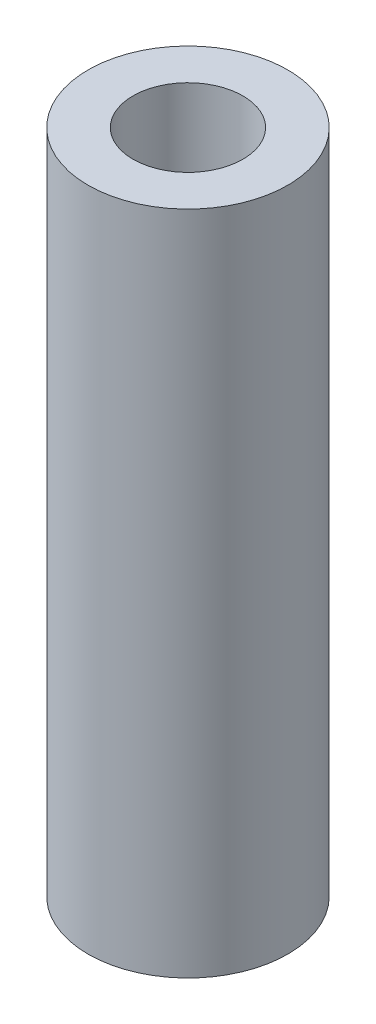
ISO-10303-21;
HEADER;
FILE_DESCRIPTION(('STEP AP214'),'2;1');
FILE_NAME('part.step','',(''),(''),'','','');
FILE_SCHEMA(('AUTOMOTIVE_DESIGN { 1 0 10303 214 1 1 1 1 }'));
ENDSEC;
DATA;
#1=APPLICATION_CONTEXT('core data for automotive mechanical design processes');
#2=APPLICATION_PROTOCOL_DEFINITION('international standard','automotive_design',2000,#1);
#3=PRODUCT_CONTEXT('',#1,'mechanical');
#4=PRODUCT('Part','Part','',(#3));
#5=PRODUCT_RELATED_PRODUCT_CATEGORY('part','',(#4));
#6=PRODUCT_DEFINITION_FORMATION('','',#4);
#7=PRODUCT_DEFINITION_CONTEXT('part definition',#1,'design');
#8=PRODUCT_DEFINITION('design','',#6,#7);
#9=PRODUCT_DEFINITION_SHAPE('','',#8);
#10=(LENGTH_UNIT() NAMED_UNIT(*) SI_UNIT(.MILLI.,.METRE.));
#11=(NAMED_UNIT(*) PLANE_ANGLE_UNIT() SI_UNIT($,.RADIAN.));
#12=(NAMED_UNIT(*) SI_UNIT($,.STERADIAN.) SOLID_ANGLE_UNIT());
#13=UNCERTAINTY_MEASURE_WITH_UNIT(LENGTH_MEASURE(1.E-05),#10,'distance_accuracy_value','');
#14=(GEOMETRIC_REPRESENTATION_CONTEXT(3) GLOBAL_UNCERTAINTY_ASSIGNED_CONTEXT((#13)) GLOBAL_UNIT_ASSIGNED_CONTEXT((#10,
#11,#12)) REPRESENTATION_CONTEXT('',''));
#15=CARTESIAN_POINT('',(0.,0.,0.));
#16=DIRECTION('',(0.,0.,1.));
#17=DIRECTION('',(1.,0.,0.));
#18=AXIS2_PLACEMENT_3D('',#15,#16,#17);
#19=CARTESIAN_POINT('',(0.,20.,0.));
#20=DIRECTION('',(0.,1.,0.));
#21=DIRECTION('',(0.,0.,1.));
#22=AXIS2_PLACEMENT_3D('',#19,#20,#21);
#23=PLANE('',#22);
#24=CARTESIAN_POINT('',(0.,20.,0.));
#25=DIRECTION('',(0.,1.,0.));
#26=DIRECTION('',(0.,0.,1.));
#27=AXIS2_PLACEMENT_3D('',#24,#25,#26);
#28=CIRCLE('',#27,3.);
#29=CARTESIAN_POINT('',(0.,20.,3.));
#30=VERTEX_POINT('',#29);
#31=EDGE_CURVE('E10',#30,#30,#28,.T.);
#32=ORIENTED_EDGE('',*,*,#31,.T.);
#33=EDGE_LOOP('',(#32));
#34=FACE_BOUND('',#33,.T.);
#35=CARTESIAN_POINT('',(0.,20.,0.));
#36=DIRECTION('',(0.,1.,0.));
#37=DIRECTION('',(0.,0.,1.));
#38=AXIS2_PLACEMENT_3D('',#35,#36,#37);
#39=CIRCLE('',#38,1.65);
#40=CARTESIAN_POINT('',(0.,20.,1.65));
#41=VERTEX_POINT('',#40);
#42=EDGE_CURVE('E42',#41,#41,#39,.T.);
#43=ORIENTED_EDGE('',*,*,#42,.F.);
#44=EDGE_LOOP('',(#43));
#45=FACE_BOUND('',#44,.T.);
#46=ADVANCED_FACE('F31',(#34,#45),#23,.T.);
#47=CARTESIAN_POINT('',(0.,0.,0.));
#48=DIRECTION('',(0.,1.,0.));
#49=DIRECTION('',(0.,0.,1.));
#50=AXIS2_PLACEMENT_3D('',#47,#48,#49);
#51=PLANE('',#50);
#52=CARTESIAN_POINT('',(0.,0.,0.));
#53=DIRECTION('',(0.,1.,0.));
#54=DIRECTION('',(0.,0.,1.));
#55=AXIS2_PLACEMENT_3D('',#52,#53,#54);
#56=CIRCLE('',#55,3.);
#57=CARTESIAN_POINT('',(0.,0.,3.));
#58=VERTEX_POINT('',#57);
#59=EDGE_CURVE('E35',#58,#58,#56,.T.);
#60=ORIENTED_EDGE('',*,*,#59,.F.);
#61=EDGE_LOOP('',(#60));
#62=FACE_BOUND('',#61,.T.);
#63=CARTESIAN_POINT('',(0.,0.,0.));
#64=DIRECTION('',(0.,1.,0.));
#65=DIRECTION('',(0.,0.,1.));
#66=AXIS2_PLACEMENT_3D('',#63,#64,#65);
#67=CIRCLE('',#66,1.65);
#68=CARTESIAN_POINT('',(0.,0.,1.65));
#69=VERTEX_POINT('',#68);
#70=EDGE_CURVE('E44',#69,#69,#67,.T.);
#71=ORIENTED_EDGE('',*,*,#70,.T.);
#72=EDGE_LOOP('',(#71));
#73=FACE_BOUND('',#72,.T.);
#74=ADVANCED_FACE('F54',(#62,#73),#51,.F.);
#75=CARTESIAN_POINT('',(0.,20.,0.));
#76=DIRECTION('',(0.,-1.,0.));
#77=DIRECTION('',(0.,0.,-1.));
#78=AXIS2_PLACEMENT_3D('',#75,#76,#77);
#79=CYLINDRICAL_SURFACE('',#78,3.);
#80=ORIENTED_EDGE('',*,*,#31,.F.);
#81=EDGE_LOOP('',(#80));
#82=FACE_BOUND('',#81,.T.);
#83=ORIENTED_EDGE('',*,*,#59,.T.);
#84=EDGE_LOOP('',(#83));
#85=FACE_BOUND('',#84,.T.);
#86=ADVANCED_FACE('F33',(#82,#85),#79,.T.);
#87=CARTESIAN_POINT('',(0.,20.,0.));
#88=DIRECTION('',(0.,-1.,0.));
#89=DIRECTION('',(0.,0.,-1.));
#90=AXIS2_PLACEMENT_3D('',#87,#88,#89);
#91=CYLINDRICAL_SURFACE('',#90,1.65);
#92=ORIENTED_EDGE('',*,*,#42,.T.);
#93=EDGE_LOOP('',(#92));
#94=FACE_BOUND('',#93,.T.);
#95=ORIENTED_EDGE('',*,*,#70,.F.);
#96=EDGE_LOOP('',(#95));
#97=FACE_BOUND('',#96,.T.);
#98=ADVANCED_FACE('F50',(#94,#97),#91,.F.);
#99=CLOSED_SHELL('',(#46,#74,#86,#98));
#100=MANIFOLD_SOLID_BREP('B2',#99);
#101=ADVANCED_BREP_SHAPE_REPRESENTATION('',(#18,#100),#14);
#102=SHAPE_DEFINITION_REPRESENTATION(#9,#101);
ENDSEC;
END-ISO-10303-21;
